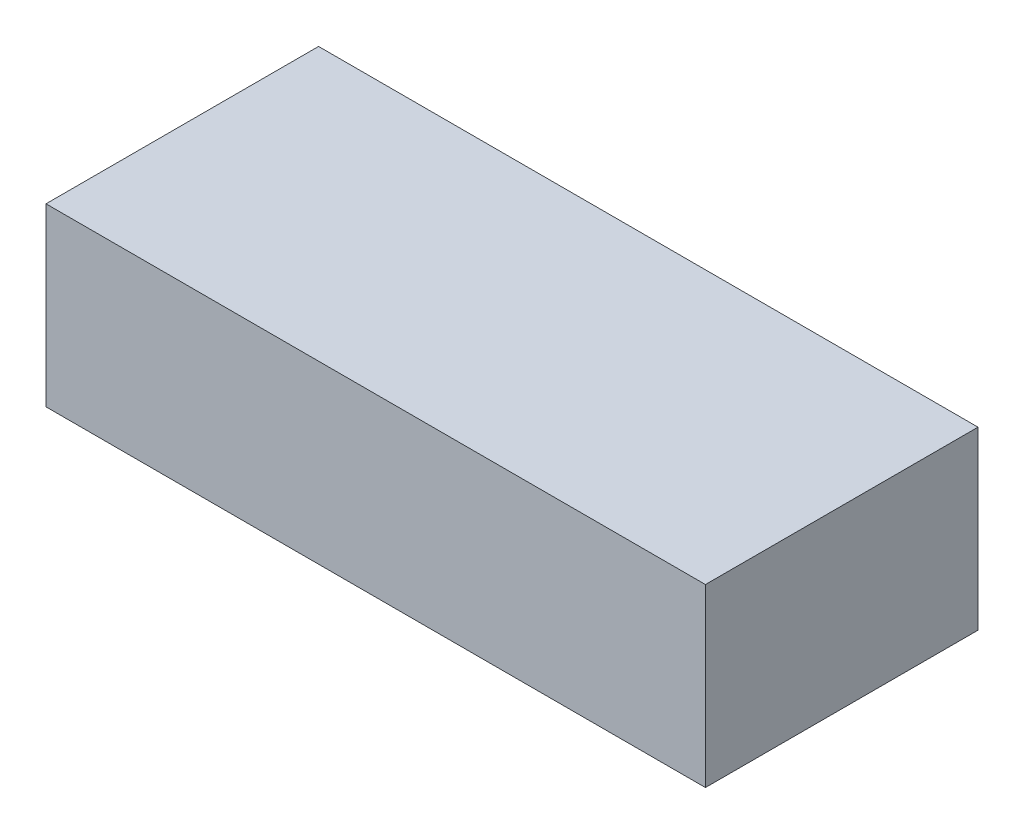
ISO-10303-21;
HEADER;
FILE_DESCRIPTION(('STEP AP214'),'2;1');
FILE_NAME('part.step','',(''),(''),'','','');
FILE_SCHEMA(('AUTOMOTIVE_DESIGN { 1 0 10303 214 1 1 1 1 }'));
ENDSEC;
DATA;
#1=APPLICATION_CONTEXT('core data for automotive mechanical design processes');
#2=APPLICATION_PROTOCOL_DEFINITION('international standard','automotive_design',2000,#1);
#3=PRODUCT_CONTEXT('',#1,'mechanical');
#4=PRODUCT('Part','Part','',(#3));
#5=PRODUCT_RELATED_PRODUCT_CATEGORY('part','',(#4));
#6=PRODUCT_DEFINITION_FORMATION('','',#4);
#7=PRODUCT_DEFINITION_CONTEXT('part definition',#1,'design');
#8=PRODUCT_DEFINITION('design','',#6,#7);
#9=PRODUCT_DEFINITION_SHAPE('','',#8);
#10=(LENGTH_UNIT() NAMED_UNIT(*) SI_UNIT(.MILLI.,.METRE.));
#11=(NAMED_UNIT(*) PLANE_ANGLE_UNIT() SI_UNIT($,.RADIAN.));
#12=(NAMED_UNIT(*) SI_UNIT($,.STERADIAN.) SOLID_ANGLE_UNIT());
#13=UNCERTAINTY_MEASURE_WITH_UNIT(LENGTH_MEASURE(1.E-05),#10,'distance_accuracy_value','');
#14=(GEOMETRIC_REPRESENTATION_CONTEXT(3) GLOBAL_UNCERTAINTY_ASSIGNED_CONTEXT((#13)) GLOBAL_UNIT_ASSIGNED_CONTEXT((#10,
#11,#12)) REPRESENTATION_CONTEXT('',''));
#15=CARTESIAN_POINT('',(0.,0.,0.));
#16=DIRECTION('',(0.,0.,1.));
#17=DIRECTION('',(1.,0.,0.));
#18=AXIS2_PLACEMENT_3D('',#15,#16,#17);
#19=CARTESIAN_POINT('',(-37.5,20.,15.5));
#20=DIRECTION('',(1.,0.,0.));
#21=DIRECTION('',(0.,0.,-1.));
#22=AXIS2_PLACEMENT_3D('',#19,#20,#21);
#23=PLANE('',#22);
#24=DIRECTION('',(0.,0.,1.));
#25=VECTOR('',#24,1.);
#26=CARTESIAN_POINT('',(-37.5,0.,15.5));
#27=LINE('',#26,#25);
#28=CARTESIAN_POINT('',(-37.5,0.,-15.5));
#29=VERTEX_POINT('',#28);
#30=CARTESIAN_POINT('',(-37.5,0.,15.5));
#31=VERTEX_POINT('',#30);
#32=EDGE_CURVE('E111',#29,#31,#27,.T.);
#33=ORIENTED_EDGE('',*,*,#32,.T.);
#34=DIRECTION('',(0.,-1.,0.));
#35=VECTOR('',#34,1.);
#36=CARTESIAN_POINT('',(-37.5,20.,15.5));
#37=LINE('',#36,#35);
#38=CARTESIAN_POINT('',(-37.5,20.,15.5));
#39=VERTEX_POINT('',#38);
#40=EDGE_CURVE('E11',#39,#31,#37,.T.);
#41=ORIENTED_EDGE('',*,*,#40,.F.);
#42=DIRECTION('',(0.,0.,1.));
#43=VECTOR('',#42,1.);
#44=CARTESIAN_POINT('',(-37.5,20.,15.5));
#45=LINE('',#44,#43);
#46=CARTESIAN_POINT('',(-37.5,20.,-15.5));
#47=VERTEX_POINT('',#46);
#48=EDGE_CURVE('E95',#47,#39,#45,.T.);
#49=ORIENTED_EDGE('',*,*,#48,.F.);
#50=DIRECTION('',(0.,-1.,0.));
#51=VECTOR('',#50,1.);
#52=CARTESIAN_POINT('',(-37.5,20.,-15.5));
#53=LINE('',#52,#51);
#54=EDGE_CURVE('E107',#47,#29,#53,.T.);
#55=ORIENTED_EDGE('',*,*,#54,.T.);
#56=EDGE_LOOP('',(#33,#41,#49,#55));
#57=FACE_BOUND('',#56,.T.);
#58=ADVANCED_FACE('F43',(#57),#23,.F.);
#59=CARTESIAN_POINT('',(37.5,20.,15.5));
#60=DIRECTION('',(0.,0.,-1.));
#61=DIRECTION('',(-1.,0.,0.));
#62=AXIS2_PLACEMENT_3D('',#59,#60,#61);
#63=PLANE('',#62);
#64=DIRECTION('',(1.,0.,0.));
#65=VECTOR('',#64,1.);
#66=CARTESIAN_POINT('',(37.5,0.,15.5));
#67=LINE('',#66,#65);
#68=CARTESIAN_POINT('',(37.5,0.,15.5));
#69=VERTEX_POINT('',#68);
#70=EDGE_CURVE('E100',#31,#69,#67,.T.);
#71=ORIENTED_EDGE('',*,*,#70,.T.);
#72=DIRECTION('',(0.,-1.,0.));
#73=VECTOR('',#72,1.);
#74=CARTESIAN_POINT('',(37.5,20.,15.5));
#75=LINE('',#74,#73);
#76=CARTESIAN_POINT('',(37.5,20.,15.5));
#77=VERTEX_POINT('',#76);
#78=EDGE_CURVE('E52',#77,#69,#75,.T.);
#79=ORIENTED_EDGE('',*,*,#78,.F.);
#80=DIRECTION('',(1.,0.,0.));
#81=VECTOR('',#80,1.);
#82=CARTESIAN_POINT('',(37.5,20.,15.5));
#83=LINE('',#82,#81);
#84=EDGE_CURVE('E90',#39,#77,#83,.T.);
#85=ORIENTED_EDGE('',*,*,#84,.F.);
#86=ORIENTED_EDGE('',*,*,#40,.T.);
#87=EDGE_LOOP('',(#71,#79,#85,#86));
#88=FACE_BOUND('',#87,.T.);
#89=ADVANCED_FACE('F99',(#88),#63,.F.);
#90=CARTESIAN_POINT('',(37.5,20.,15.5));
#91=DIRECTION('',(-1.,0.,0.));
#92=DIRECTION('',(0.,0.,1.));
#93=AXIS2_PLACEMENT_3D('',#90,#91,#92);
#94=PLANE('',#93);
#95=DIRECTION('',(0.,0.,-1.));
#96=VECTOR('',#95,1.);
#97=CARTESIAN_POINT('',(37.5,0.,15.5));
#98=LINE('',#97,#96);
#99=CARTESIAN_POINT('',(37.5,0.,-15.5));
#100=VERTEX_POINT('',#99);
#101=EDGE_CURVE('E77',#69,#100,#98,.T.);
#102=ORIENTED_EDGE('',*,*,#101,.T.);
#103=DIRECTION('',(0.,-1.,0.));
#104=VECTOR('',#103,1.);
#105=CARTESIAN_POINT('',(37.5,20.,-15.5));
#106=LINE('',#105,#104);
#107=CARTESIAN_POINT('',(37.5,20.,-15.5));
#108=VERTEX_POINT('',#107);
#109=EDGE_CURVE('E102',#108,#100,#106,.T.);
#110=ORIENTED_EDGE('',*,*,#109,.F.);
#111=DIRECTION('',(0.,0.,-1.));
#112=VECTOR('',#111,1.);
#113=CARTESIAN_POINT('',(37.5,20.,15.5));
#114=LINE('',#113,#112);
#115=EDGE_CURVE('E93',#77,#108,#114,.T.);
#116=ORIENTED_EDGE('',*,*,#115,.F.);
#117=ORIENTED_EDGE('',*,*,#78,.T.);
#118=EDGE_LOOP('',(#102,#110,#116,#117));
#119=FACE_BOUND('',#118,.T.);
#120=ADVANCED_FACE('F103',(#119),#94,.F.);
#121=CARTESIAN_POINT('',(37.5,20.,-15.5));
#122=DIRECTION('',(0.,0.,1.));
#123=DIRECTION('',(1.,0.,0.));
#124=AXIS2_PLACEMENT_3D('',#121,#122,#123);
#125=PLANE('',#124);
#126=DIRECTION('',(-1.,0.,0.));
#127=VECTOR('',#126,1.);
#128=CARTESIAN_POINT('',(37.5,0.,-15.5));
#129=LINE('',#128,#127);
#130=EDGE_CURVE('E83',#100,#29,#129,.T.);
#131=ORIENTED_EDGE('',*,*,#130,.T.);
#132=ORIENTED_EDGE('',*,*,#54,.F.);
#133=DIRECTION('',(-1.,0.,0.));
#134=VECTOR('',#133,1.);
#135=CARTESIAN_POINT('',(37.5,20.,-15.5));
#136=LINE('',#135,#134);
#137=EDGE_CURVE('E60',#108,#47,#136,.T.);
#138=ORIENTED_EDGE('',*,*,#137,.F.);
#139=ORIENTED_EDGE('',*,*,#109,.T.);
#140=EDGE_LOOP('',(#131,#132,#138,#139));
#141=FACE_BOUND('',#140,.T.);
#142=ADVANCED_FACE('F124',(#141),#125,.F.);
#143=CARTESIAN_POINT('',(0.,20.,0.));
#144=DIRECTION('',(0.,1.,0.));
#145=DIRECTION('',(0.,0.,1.));
#146=AXIS2_PLACEMENT_3D('',#143,#144,#145);
#147=PLANE('',#146);
#148=ORIENTED_EDGE('',*,*,#48,.T.);
#149=ORIENTED_EDGE('',*,*,#84,.T.);
#150=ORIENTED_EDGE('',*,*,#115,.T.);
#151=ORIENTED_EDGE('',*,*,#137,.T.);
#152=EDGE_LOOP('',(#148,#149,#150,#151));
#153=FACE_BOUND('',#152,.T.);
#154=ADVANCED_FACE('F91',(#153),#147,.T.);
#155=CARTESIAN_POINT('',(0.,0.,0.));
#156=DIRECTION('',(0.,1.,0.));
#157=DIRECTION('',(0.,0.,1.));
#158=AXIS2_PLACEMENT_3D('',#155,#156,#157);
#159=PLANE('',#158);
#160=ORIENTED_EDGE('',*,*,#32,.F.);
#161=ORIENTED_EDGE('',*,*,#130,.F.);
#162=ORIENTED_EDGE('',*,*,#101,.F.);
#163=ORIENTED_EDGE('',*,*,#70,.F.);
#164=EDGE_LOOP('',(#160,#161,#162,#163));
#165=FACE_BOUND('',#164,.T.);
#166=ADVANCED_FACE('F127',(#165),#159,.F.);
#167=CLOSED_SHELL('',(#58,#89,#120,#142,#154,#166));
#168=MANIFOLD_SOLID_BREP('B2',#167);
#169=ADVANCED_BREP_SHAPE_REPRESENTATION('',(#18,#168),#14);
#170=SHAPE_DEFINITION_REPRESENTATION(#9,#169);
ENDSEC;
END-ISO-10303-21;
